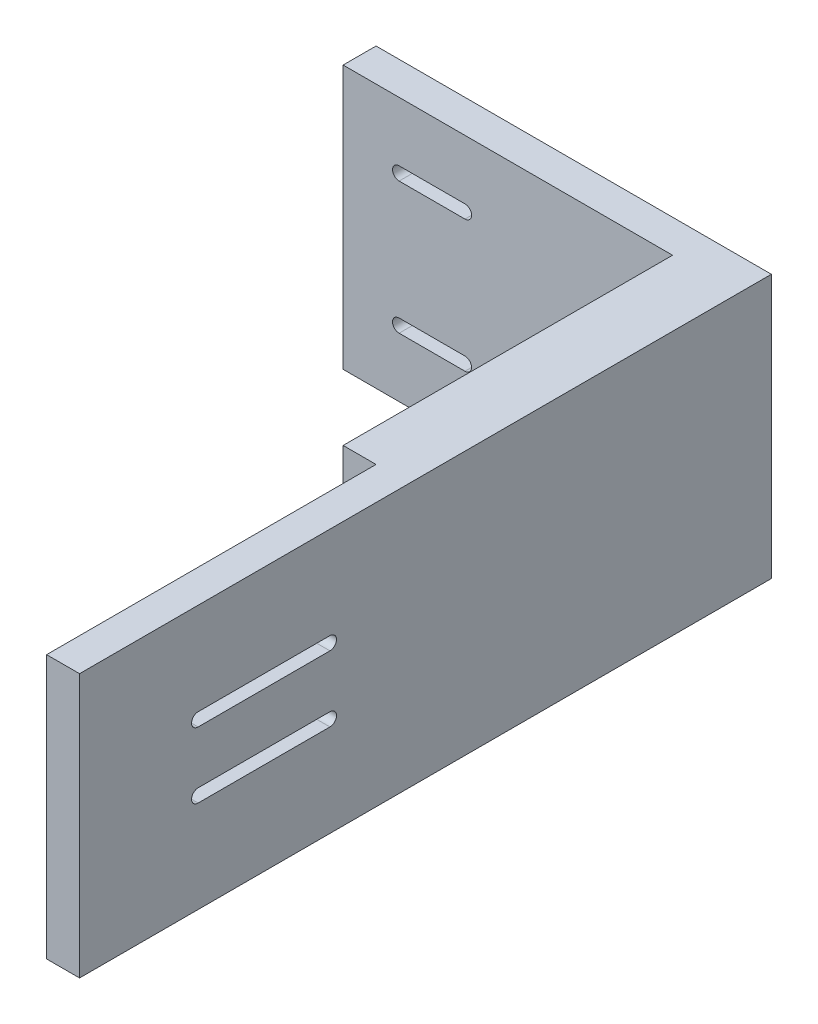
ISO-10303-21;
HEADER;
FILE_DESCRIPTION(('STEP AP214'),'2;1');
FILE_NAME('part.step','',(''),(''),'','','');
FILE_SCHEMA(('AUTOMOTIVE_DESIGN { 1 0 10303 214 1 1 1 1 }'));
ENDSEC;
DATA;
#1=APPLICATION_CONTEXT('core data for automotive mechanical design processes');
#2=APPLICATION_PROTOCOL_DEFINITION('international standard','automotive_design',2000,#1);
#3=PRODUCT_CONTEXT('',#1,'mechanical');
#4=PRODUCT('Part','Part','',(#3));
#5=PRODUCT_RELATED_PRODUCT_CATEGORY('part','',(#4));
#6=PRODUCT_DEFINITION_FORMATION('','',#4);
#7=PRODUCT_DEFINITION_CONTEXT('part definition',#1,'design');
#8=PRODUCT_DEFINITION('design','',#6,#7);
#9=PRODUCT_DEFINITION_SHAPE('','',#8);
#10=(LENGTH_UNIT() NAMED_UNIT(*) SI_UNIT(.MILLI.,.METRE.));
#11=(NAMED_UNIT(*) PLANE_ANGLE_UNIT() SI_UNIT($,.RADIAN.));
#12=(NAMED_UNIT(*) SI_UNIT($,.STERADIAN.) SOLID_ANGLE_UNIT());
#13=UNCERTAINTY_MEASURE_WITH_UNIT(LENGTH_MEASURE(1.E-05),#10,'distance_accuracy_value','');
#14=(GEOMETRIC_REPRESENTATION_CONTEXT(3) GLOBAL_UNCERTAINTY_ASSIGNED_CONTEXT((#13)) GLOBAL_UNIT_ASSIGNED_CONTEXT((#10,
#11,#12)) REPRESENTATION_CONTEXT('',''));
#15=CARTESIAN_POINT('',(0.,0.,0.));
#16=DIRECTION('',(0.,0.,1.));
#17=DIRECTION('',(1.,0.,0.));
#18=AXIS2_PLACEMENT_3D('',#15,#16,#17);
#19=CARTESIAN_POINT('',(30.,20.,5.));
#20=DIRECTION('',(-1.,0.,0.));
#21=DIRECTION('',(0.,-1.,0.));
#22=AXIS2_PLACEMENT_3D('',#19,#20,#21);
#23=PLANE('',#22);
#24=DIRECTION('',(0.,0.,-1.));
#25=VECTOR('',#24,1.);
#26=CARTESIAN_POINT('',(30.,6.,67.));
#27=LINE('',#26,#25);
#28=CARTESIAN_POINT('',(30.,6.,87.));
#29=VERTEX_POINT('',#28);
#30=CARTESIAN_POINT('',(30.,6.,67.));
#31=VERTEX_POINT('',#30);
#32=EDGE_CURVE('E358',#29,#31,#27,.T.);
#33=ORIENTED_EDGE('',*,*,#32,.T.);
#34=CARTESIAN_POINT('',(30.,5.,67.));
#35=DIRECTION('',(-1.,0.,0.));
#36=DIRECTION('',(0.,0.,1.));
#37=AXIS2_PLACEMENT_3D('',#34,#35,#36);
#38=CIRCLE('',#37,1.);
#39=CARTESIAN_POINT('',(30.,4.,67.));
#40=VERTEX_POINT('',#39);
#41=EDGE_CURVE('E345',#31,#40,#38,.T.);
#42=ORIENTED_EDGE('',*,*,#41,.T.);
#43=DIRECTION('',(0.,0.,1.));
#44=VECTOR('',#43,1.);
#45=CARTESIAN_POINT('',(30.,4.,67.));
#46=LINE('',#45,#44);
#47=CARTESIAN_POINT('',(30.,4.,87.));
#48=VERTEX_POINT('',#47);
#49=EDGE_CURVE('E349',#40,#48,#46,.T.);
#50=ORIENTED_EDGE('',*,*,#49,.T.);
#51=CARTESIAN_POINT('',(30.,5.,87.));
#52=DIRECTION('',(-1.,0.,0.));
#53=DIRECTION('',(0.,0.,1.));
#54=AXIS2_PLACEMENT_3D('',#51,#52,#53);
#55=CIRCLE('',#54,1.);
#56=EDGE_CURVE('E354',#48,#29,#55,.T.);
#57=ORIENTED_EDGE('',*,*,#56,.T.);
#58=EDGE_LOOP('',(#33,#42,#50,#57));
#59=FACE_BOUND('',#58,.T.);
#60=DIRECTION('',(0.,0.,-1.));
#61=VECTOR('',#60,1.);
#62=CARTESIAN_POINT('',(30.,-4.,67.));
#63=LINE('',#62,#61);
#64=CARTESIAN_POINT('',(30.,-4.,87.));
#65=VERTEX_POINT('',#64);
#66=CARTESIAN_POINT('',(30.,-4.,67.));
#67=VERTEX_POINT('',#66);
#68=EDGE_CURVE('E390',#65,#67,#63,.T.);
#69=ORIENTED_EDGE('',*,*,#68,.T.);
#70=CARTESIAN_POINT('',(30.,-5.,67.));
#71=DIRECTION('',(-1.,0.,0.));
#72=DIRECTION('',(0.,0.,-1.));
#73=AXIS2_PLACEMENT_3D('',#70,#71,#72);
#74=CIRCLE('',#73,1.);
#75=CARTESIAN_POINT('',(30.,-6.,67.));
#76=VERTEX_POINT('',#75);
#77=EDGE_CURVE('E344',#67,#76,#74,.T.);
#78=ORIENTED_EDGE('',*,*,#77,.T.);
#79=DIRECTION('',(0.,0.,1.));
#80=VECTOR('',#79,1.);
#81=CARTESIAN_POINT('',(30.,-6.,67.));
#82=LINE('',#81,#80);
#83=CARTESIAN_POINT('',(30.,-6.,87.));
#84=VERTEX_POINT('',#83);
#85=EDGE_CURVE('E382',#76,#84,#82,.T.);
#86=ORIENTED_EDGE('',*,*,#85,.T.);
#87=CARTESIAN_POINT('',(30.,-5.,87.));
#88=DIRECTION('',(-1.,0.,0.));
#89=DIRECTION('',(0.,0.,-1.));
#90=AXIS2_PLACEMENT_3D('',#87,#88,#89);
#91=CIRCLE('',#90,1.);
#92=EDGE_CURVE('E386',#84,#65,#91,.T.);
#93=ORIENTED_EDGE('',*,*,#92,.T.);
#94=EDGE_LOOP('',(#69,#78,#86,#93));
#95=FACE_BOUND('',#94,.T.);
#96=DIRECTION('',(0.,1.,0.));
#97=VECTOR('',#96,1.);
#98=CARTESIAN_POINT('',(30.,20.,0.));
#99=LINE('',#98,#97);
#100=CARTESIAN_POINT('',(30.,-20.,0.));
#101=VERTEX_POINT('',#100);
#102=CARTESIAN_POINT('',(30.,20.,0.));
#103=VERTEX_POINT('',#102);
#104=EDGE_CURVE('E433',#101,#103,#99,.T.);
#105=ORIENTED_EDGE('',*,*,#104,.T.);
#106=DIRECTION('',(0.,0.,-1.));
#107=VECTOR('',#106,1.);
#108=CARTESIAN_POINT('',(30.,20.,5.));
#109=LINE('',#108,#107);
#110=CARTESIAN_POINT('',(30.,20.,105.));
#111=VERTEX_POINT('',#110);
#112=EDGE_CURVE('E468',#111,#103,#109,.T.);
#113=ORIENTED_EDGE('',*,*,#112,.F.);
#114=DIRECTION('',(0.,1.,0.));
#115=VECTOR('',#114,1.);
#116=CARTESIAN_POINT('',(30.,20.,105.));
#117=LINE('',#116,#115);
#118=CARTESIAN_POINT('',(30.,-20.,105.));
#119=VERTEX_POINT('',#118);
#120=EDGE_CURVE('E416',#119,#111,#117,.T.);
#121=ORIENTED_EDGE('',*,*,#120,.F.);
#122=DIRECTION('',(0.,0.,-1.));
#123=VECTOR('',#122,1.);
#124=CARTESIAN_POINT('',(30.,-20.,5.));
#125=LINE('',#124,#123);
#126=EDGE_CURVE('E445',#119,#101,#125,.T.);
#127=ORIENTED_EDGE('',*,*,#126,.T.);
#128=EDGE_LOOP('',(#105,#113,#121,#127));
#129=FACE_BOUND('',#128,.T.);
#130=ADVANCED_FACE('F39',(#59,#95,#129),#23,.F.);
#131=CARTESIAN_POINT('',(-30.,20.,5.));
#132=DIRECTION('',(0.,-1.,0.));
#133=DIRECTION('',(0.,0.,-1.));
#134=AXIS2_PLACEMENT_3D('',#131,#132,#133);
#135=PLANE('',#134);
#136=DIRECTION('',(1.,0.,0.));
#137=VECTOR('',#136,1.);
#138=CARTESIAN_POINT('',(20.,20.,55.));
#139=LINE('',#138,#137);
#140=CARTESIAN_POINT('',(20.,20.,55.));
#141=VERTEX_POINT('',#140);
#142=CARTESIAN_POINT('',(25.,20.,55.));
#143=VERTEX_POINT('',#142);
#144=EDGE_CURVE('E292',#141,#143,#139,.T.);
#145=ORIENTED_EDGE('',*,*,#144,.T.);
#146=DIRECTION('',(0.,0.,1.));
#147=VECTOR('',#146,1.);
#148=CARTESIAN_POINT('',(25.,20.,105.));
#149=LINE('',#148,#147);
#150=CARTESIAN_POINT('',(25.,20.,105.));
#151=VERTEX_POINT('',#150);
#152=EDGE_CURVE('E296',#143,#151,#149,.T.);
#153=ORIENTED_EDGE('',*,*,#152,.T.);
#154=DIRECTION('',(-1.,0.,0.));
#155=VECTOR('',#154,1.);
#156=CARTESIAN_POINT('',(20.,20.,105.));
#157=LINE('',#156,#155);
#158=EDGE_CURVE('E420',#111,#151,#157,.T.);
#159=ORIENTED_EDGE('',*,*,#158,.F.);
#160=ORIENTED_EDGE('',*,*,#112,.T.);
#161=DIRECTION('',(-1.,0.,0.));
#162=VECTOR('',#161,1.);
#163=CARTESIAN_POINT('',(-30.,20.,0.));
#164=LINE('',#163,#162);
#165=CARTESIAN_POINT('',(-30.,20.,0.));
#166=VERTEX_POINT('',#165);
#167=EDGE_CURVE('E449',#103,#166,#164,.T.);
#168=ORIENTED_EDGE('',*,*,#167,.T.);
#169=DIRECTION('',(0.,0.,-1.));
#170=VECTOR('',#169,1.);
#171=CARTESIAN_POINT('',(-30.,20.,5.));
#172=LINE('',#171,#170);
#173=CARTESIAN_POINT('',(-30.,20.,5.));
#174=VERTEX_POINT('',#173);
#175=EDGE_CURVE('E464',#174,#166,#172,.T.);
#176=ORIENTED_EDGE('',*,*,#175,.F.);
#177=DIRECTION('',(-1.,0.,0.));
#178=VECTOR('',#177,1.);
#179=CARTESIAN_POINT('',(-30.,20.,5.));
#180=LINE('',#179,#178);
#181=CARTESIAN_POINT('',(20.,20.,5.));
#182=VERTEX_POINT('',#181);
#183=EDGE_CURVE('E434',#182,#174,#180,.T.);
#184=ORIENTED_EDGE('',*,*,#183,.F.);
#185=DIRECTION('',(0.,0.,-1.));
#186=VECTOR('',#185,1.);
#187=CARTESIAN_POINT('',(20.,20.,105.));
#188=LINE('',#187,#186);
#189=EDGE_CURVE('E424',#141,#182,#188,.T.);
#190=ORIENTED_EDGE('',*,*,#189,.F.);
#191=EDGE_LOOP('',(#145,#153,#159,#160,#168,#176,#184,#190));
#192=FACE_BOUND('',#191,.T.);
#193=ADVANCED_FACE('F514',(#192),#135,.F.);
#194=CARTESIAN_POINT('',(-30.,20.,5.));
#195=DIRECTION('',(1.,0.,0.));
#196=DIRECTION('',(0.,1.,0.));
#197=AXIS2_PLACEMENT_3D('',#194,#195,#196);
#198=PLANE('',#197);
#199=DIRECTION('',(0.,-1.,0.));
#200=VECTOR('',#199,1.);
#201=CARTESIAN_POINT('',(-30.,20.,0.));
#202=LINE('',#201,#200);
#203=CARTESIAN_POINT('',(-30.,-20.,0.));
#204=VERTEX_POINT('',#203);
#205=EDGE_CURVE('E452',#166,#204,#202,.T.);
#206=ORIENTED_EDGE('',*,*,#205,.T.);
#207=DIRECTION('',(0.,0.,-1.));
#208=VECTOR('',#207,1.);
#209=CARTESIAN_POINT('',(-30.,-20.,5.));
#210=LINE('',#209,#208);
#211=CARTESIAN_POINT('',(-30.,-20.,5.));
#212=VERTEX_POINT('',#211);
#213=EDGE_CURVE('E460',#212,#204,#210,.T.);
#214=ORIENTED_EDGE('',*,*,#213,.F.);
#215=DIRECTION('',(0.,-1.,0.));
#216=VECTOR('',#215,1.);
#217=CARTESIAN_POINT('',(-30.,20.,5.));
#218=LINE('',#217,#216);
#219=EDGE_CURVE('E437',#174,#212,#218,.T.);
#220=ORIENTED_EDGE('',*,*,#219,.F.);
#221=ORIENTED_EDGE('',*,*,#175,.T.);
#222=EDGE_LOOP('',(#206,#214,#220,#221));
#223=FACE_BOUND('',#222,.T.);
#224=ADVANCED_FACE('F499',(#223),#198,.F.);
#225=CARTESIAN_POINT('',(-30.,-20.,5.));
#226=DIRECTION('',(0.,1.,0.));
#227=DIRECTION('',(0.,0.,1.));
#228=AXIS2_PLACEMENT_3D('',#225,#226,#227);
#229=PLANE('',#228);
#230=DIRECTION('',(1.,0.,0.));
#231=VECTOR('',#230,1.);
#232=CARTESIAN_POINT('',(20.,-20.,105.));
#233=LINE('',#232,#231);
#234=CARTESIAN_POINT('',(25.,-20.,105.));
#235=VERTEX_POINT('',#234);
#236=EDGE_CURVE('E413',#235,#119,#233,.T.);
#237=ORIENTED_EDGE('',*,*,#236,.F.);
#238=DIRECTION('',(0.,0.,1.));
#239=VECTOR('',#238,1.);
#240=CARTESIAN_POINT('',(25.,-20.,105.));
#241=LINE('',#240,#239);
#242=CARTESIAN_POINT('',(25.,-20.,55.));
#243=VERTEX_POINT('',#242);
#244=EDGE_CURVE('E297',#243,#235,#241,.T.);
#245=ORIENTED_EDGE('',*,*,#244,.F.);
#246=DIRECTION('',(1.,0.,0.));
#247=VECTOR('',#246,1.);
#248=CARTESIAN_POINT('',(20.,-20.,55.));
#249=LINE('',#248,#247);
#250=CARTESIAN_POINT('',(20.,-20.,55.));
#251=VERTEX_POINT('',#250);
#252=EDGE_CURVE('E218',#251,#243,#249,.T.);
#253=ORIENTED_EDGE('',*,*,#252,.F.);
#254=DIRECTION('',(0.,0.,-1.));
#255=VECTOR('',#254,1.);
#256=CARTESIAN_POINT('',(20.,-20.,105.));
#257=LINE('',#256,#255);
#258=CARTESIAN_POINT('',(20.,-20.,5.));
#259=VERTEX_POINT('',#258);
#260=EDGE_CURVE('E430',#251,#259,#257,.T.);
#261=ORIENTED_EDGE('',*,*,#260,.T.);
#262=DIRECTION('',(1.,0.,0.));
#263=VECTOR('',#262,1.);
#264=CARTESIAN_POINT('',(-30.,-20.,5.));
#265=LINE('',#264,#263);
#266=EDGE_CURVE('E441',#212,#259,#265,.T.);
#267=ORIENTED_EDGE('',*,*,#266,.F.);
#268=ORIENTED_EDGE('',*,*,#213,.T.);
#269=DIRECTION('',(1.,0.,0.));
#270=VECTOR('',#269,1.);
#271=CARTESIAN_POINT('',(-30.,-20.,0.));
#272=LINE('',#271,#270);
#273=EDGE_CURVE('E438',#204,#101,#272,.T.);
#274=ORIENTED_EDGE('',*,*,#273,.T.);
#275=ORIENTED_EDGE('',*,*,#126,.F.);
#276=EDGE_LOOP('',(#237,#245,#253,#261,#267,#268,#274,#275));
#277=FACE_BOUND('',#276,.T.);
#278=ADVANCED_FACE('F490',(#277),#229,.F.);
#279=CARTESIAN_POINT('',(0.,0.,5.));
#280=DIRECTION('',(0.,0.,1.));
#281=DIRECTION('',(1.,0.,0.));
#282=AXIS2_PLACEMENT_3D('',#279,#280,#281);
#283=PLANE('',#282);
#284=CARTESIAN_POINT('',(-11.5,10.,5.));
#285=DIRECTION('',(0.,0.,1.));
#286=DIRECTION('',(1.,0.,0.));
#287=AXIS2_PLACEMENT_3D('',#284,#285,#286);
#288=CIRCLE('',#287,0.99853166404924);
#289=CARTESIAN_POINT('',(-11.5,9.00146833595076,5.));
#290=VERTEX_POINT('',#289);
#291=CARTESIAN_POINT('',(-11.5,10.9985316640492,5.));
#292=VERTEX_POINT('',#291);
#293=EDGE_CURVE('E54',#290,#292,#288,.T.);
#294=ORIENTED_EDGE('',*,*,#293,.F.);
#295=DIRECTION('',(1.,0.,0.));
#296=VECTOR('',#295,1.);
#297=CARTESIAN_POINT('',(-11.5,9.00146833595076,5.));
#298=LINE('',#297,#296);
#299=CARTESIAN_POINT('',(-21.5,9.00146833595076,5.));
#300=VERTEX_POINT('',#299);
#301=EDGE_CURVE('E209',#300,#290,#298,.T.);
#302=ORIENTED_EDGE('',*,*,#301,.F.);
#303=CARTESIAN_POINT('',(-21.5,10.,5.));
#304=DIRECTION('',(0.,0.,1.));
#305=DIRECTION('',(1.,0.,0.));
#306=AXIS2_PLACEMENT_3D('',#303,#304,#305);
#307=CIRCLE('',#306,0.99853166404924);
#308=CARTESIAN_POINT('',(-21.5,10.9985316640492,5.));
#309=VERTEX_POINT('',#308);
#310=EDGE_CURVE('E237',#309,#300,#307,.T.);
#311=ORIENTED_EDGE('',*,*,#310,.F.);
#312=DIRECTION('',(-1.,0.,0.));
#313=VECTOR('',#312,1.);
#314=CARTESIAN_POINT('',(-11.5,10.9985316640492,5.));
#315=LINE('',#314,#313);
#316=EDGE_CURVE('E229',#292,#309,#315,.T.);
#317=ORIENTED_EDGE('',*,*,#316,.F.);
#318=EDGE_LOOP('',(#294,#302,#311,#317));
#319=FACE_BOUND('',#318,.T.);
#320=CARTESIAN_POINT('',(-11.5,-10.,5.));
#321=DIRECTION('',(0.,0.,1.));
#322=DIRECTION('',(-1.,0.,0.));
#323=AXIS2_PLACEMENT_3D('',#320,#321,#322);
#324=CIRCLE('',#323,0.99853166404924);
#325=CARTESIAN_POINT('',(-11.5,-10.9985316640492,5.));
#326=VERTEX_POINT('',#325);
#327=CARTESIAN_POINT('',(-11.5,-9.00146833595076,5.));
#328=VERTEX_POINT('',#327);
#329=EDGE_CURVE('E62',#326,#328,#324,.T.);
#330=ORIENTED_EDGE('',*,*,#329,.F.);
#331=DIRECTION('',(1.,0.,0.));
#332=VECTOR('',#331,1.);
#333=CARTESIAN_POINT('',(-11.5,-10.9985316640492,5.));
#334=LINE('',#333,#332);
#335=CARTESIAN_POINT('',(-21.5,-10.9985316640492,5.));
#336=VERTEX_POINT('',#335);
#337=EDGE_CURVE('E272',#336,#326,#334,.T.);
#338=ORIENTED_EDGE('',*,*,#337,.F.);
#339=CARTESIAN_POINT('',(-21.5,-10.,5.));
#340=DIRECTION('',(0.,0.,1.));
#341=DIRECTION('',(-1.,0.,0.));
#342=AXIS2_PLACEMENT_3D('',#339,#340,#341);
#343=CIRCLE('',#342,0.99853166404924);
#344=CARTESIAN_POINT('',(-21.5,-9.00146833595076,5.));
#345=VERTEX_POINT('',#344);
#346=EDGE_CURVE('E268',#345,#336,#343,.T.);
#347=ORIENTED_EDGE('',*,*,#346,.F.);
#348=DIRECTION('',(-1.,0.,0.));
#349=VECTOR('',#348,1.);
#350=CARTESIAN_POINT('',(-11.5,-9.00146833595076,5.));
#351=LINE('',#350,#349);
#352=EDGE_CURVE('E264',#328,#345,#351,.T.);
#353=ORIENTED_EDGE('',*,*,#352,.F.);
#354=EDGE_LOOP('',(#330,#338,#347,#353));
#355=FACE_BOUND('',#354,.T.);
#356=DIRECTION('',(0.,-1.,0.));
#357=VECTOR('',#356,1.);
#358=CARTESIAN_POINT('',(20.,20.,5.));
#359=LINE('',#358,#357);
#360=EDGE_CURVE('E412',#182,#259,#359,.T.);
#361=ORIENTED_EDGE('',*,*,#360,.F.);
#362=ORIENTED_EDGE('',*,*,#183,.T.);
#363=ORIENTED_EDGE('',*,*,#219,.T.);
#364=ORIENTED_EDGE('',*,*,#266,.T.);
#365=EDGE_LOOP('',(#361,#362,#363,#364));
#366=FACE_BOUND('',#365,.T.);
#367=ADVANCED_FACE('F493',(#319,#355,#366),#283,.T.);
#368=CARTESIAN_POINT('',(0.,0.,0.));
#369=DIRECTION('',(0.,0.,1.));
#370=DIRECTION('',(1.,0.,0.));
#371=AXIS2_PLACEMENT_3D('',#368,#369,#370);
#372=PLANE('',#371);
#373=DIRECTION('',(-1.,0.,0.));
#374=VECTOR('',#373,1.);
#375=CARTESIAN_POINT('',(-11.5,9.00146833595076,0.));
#376=LINE('',#375,#374);
#377=CARTESIAN_POINT('',(-11.5,9.00146833595076,0.));
#378=VERTEX_POINT('',#377);
#379=CARTESIAN_POINT('',(-21.5,9.00146833595076,0.));
#380=VERTEX_POINT('',#379);
#381=EDGE_CURVE('E224',#378,#380,#376,.T.);
#382=ORIENTED_EDGE('',*,*,#381,.F.);
#383=CARTESIAN_POINT('',(-11.5,10.,0.));
#384=DIRECTION('',(0.,0.,1.));
#385=DIRECTION('',(1.,0.,0.));
#386=AXIS2_PLACEMENT_3D('',#383,#384,#385);
#387=CIRCLE('',#386,0.99853166404924);
#388=CARTESIAN_POINT('',(-11.5,10.9985316640492,0.));
#389=VERTEX_POINT('',#388);
#390=EDGE_CURVE('E202',#389,#378,#387,.F.);
#391=ORIENTED_EDGE('',*,*,#390,.F.);
#392=DIRECTION('',(1.,0.,0.));
#393=VECTOR('',#392,1.);
#394=CARTESIAN_POINT('',(-11.5,10.9985316640492,0.));
#395=LINE('',#394,#393);
#396=CARTESIAN_POINT('',(-21.5,10.9985316640492,0.));
#397=VERTEX_POINT('',#396);
#398=EDGE_CURVE('E213',#397,#389,#395,.T.);
#399=ORIENTED_EDGE('',*,*,#398,.F.);
#400=CARTESIAN_POINT('',(-21.5,10.,0.));
#401=DIRECTION('',(0.,0.,1.));
#402=DIRECTION('',(1.,0.,0.));
#403=AXIS2_PLACEMENT_3D('',#400,#401,#402);
#404=CIRCLE('',#403,0.99853166404924);
#405=EDGE_CURVE('E231',#380,#397,#404,.F.);
#406=ORIENTED_EDGE('',*,*,#405,.F.);
#407=EDGE_LOOP('',(#382,#391,#399,#406));
#408=FACE_BOUND('',#407,.T.);
#409=DIRECTION('',(-1.,0.,0.));
#410=VECTOR('',#409,1.);
#411=CARTESIAN_POINT('',(-11.5,-10.9985316640492,0.));
#412=LINE('',#411,#410);
#413=CARTESIAN_POINT('',(-11.5,-10.9985316640492,0.));
#414=VERTEX_POINT('',#413);
#415=CARTESIAN_POINT('',(-21.5,-10.9985316640492,0.));
#416=VERTEX_POINT('',#415);
#417=EDGE_CURVE('E254',#414,#416,#412,.T.);
#418=ORIENTED_EDGE('',*,*,#417,.F.);
#419=CARTESIAN_POINT('',(-11.5,-10.,0.));
#420=DIRECTION('',(0.,0.,1.));
#421=DIRECTION('',(1.,0.,0.));
#422=AXIS2_PLACEMENT_3D('',#419,#420,#421);
#423=CIRCLE('',#422,0.99853166404924);
#424=CARTESIAN_POINT('',(-11.5,-9.00146833595076,0.));
#425=VERTEX_POINT('',#424);
#426=EDGE_CURVE('E258',#425,#414,#423,.F.);
#427=ORIENTED_EDGE('',*,*,#426,.F.);
#428=DIRECTION('',(1.,0.,0.));
#429=VECTOR('',#428,1.);
#430=CARTESIAN_POINT('',(-11.5,-9.00146833595076,0.));
#431=LINE('',#430,#429);
#432=CARTESIAN_POINT('',(-21.5,-9.00146833595076,0.));
#433=VERTEX_POINT('',#432);
#434=EDGE_CURVE('E280',#433,#425,#431,.T.);
#435=ORIENTED_EDGE('',*,*,#434,.F.);
#436=CARTESIAN_POINT('',(-21.5,-10.,0.));
#437=DIRECTION('',(0.,0.,1.));
#438=DIRECTION('',(1.,0.,0.));
#439=AXIS2_PLACEMENT_3D('',#436,#437,#438);
#440=CIRCLE('',#439,0.99853166404924);
#441=EDGE_CURVE('E251',#416,#433,#440,.F.);
#442=ORIENTED_EDGE('',*,*,#441,.F.);
#443=EDGE_LOOP('',(#418,#427,#435,#442));
#444=FACE_BOUND('',#443,.T.);
#445=ORIENTED_EDGE('',*,*,#104,.F.);
#446=ORIENTED_EDGE('',*,*,#273,.F.);
#447=ORIENTED_EDGE('',*,*,#205,.F.);
#448=ORIENTED_EDGE('',*,*,#167,.F.);
#449=EDGE_LOOP('',(#445,#446,#447,#448));
#450=FACE_BOUND('',#449,.T.);
#451=ADVANCED_FACE('F221',(#408,#444,#450),#372,.F.);
#452=CARTESIAN_POINT('',(20.,20.,105.));
#453=DIRECTION('',(1.,0.,0.));
#454=DIRECTION('',(0.,1.,0.));
#455=AXIS2_PLACEMENT_3D('',#452,#453,#454);
#456=PLANE('',#455);
#457=CARTESIAN_POINT('',(20.,0.,30.));
#458=DIRECTION('',(1.,0.,0.));
#459=DIRECTION('',(0.,1.,0.));
#460=AXIS2_PLACEMENT_3D('',#457,#458,#459);
#461=CIRCLE('',#460,0.999999999999998);
#462=CARTESIAN_POINT('',(20.,1.,30.));
#463=VERTEX_POINT('',#462);
#464=EDGE_CURVE('E47',#463,#463,#461,.F.);
#465=ORIENTED_EDGE('',*,*,#464,.F.);
#466=EDGE_LOOP('',(#465));
#467=FACE_BOUND('',#466,.T.);
#468=ORIENTED_EDGE('',*,*,#260,.F.);
#469=DIRECTION('',(0.,-1.,0.));
#470=VECTOR('',#469,1.);
#471=CARTESIAN_POINT('',(20.,20.,55.));
#472=LINE('',#471,#470);
#473=EDGE_CURVE('E301',#141,#251,#472,.T.);
#474=ORIENTED_EDGE('',*,*,#473,.F.);
#475=ORIENTED_EDGE('',*,*,#189,.T.);
#476=ORIENTED_EDGE('',*,*,#360,.T.);
#477=EDGE_LOOP('',(#468,#474,#475,#476));
#478=FACE_BOUND('',#477,.T.);
#479=ADVANCED_FACE('F477',(#467,#478),#456,.F.);
#480=CARTESIAN_POINT('',(0.,0.,105.));
#481=DIRECTION('',(0.,0.,1.));
#482=DIRECTION('',(1.,0.,0.));
#483=AXIS2_PLACEMENT_3D('',#480,#481,#482);
#484=PLANE('',#483);
#485=DIRECTION('',(0.,-1.,0.));
#486=VECTOR('',#485,1.);
#487=CARTESIAN_POINT('',(25.,20.,105.));
#488=LINE('',#487,#486);
#489=EDGE_CURVE('E307',#151,#235,#488,.T.);
#490=ORIENTED_EDGE('',*,*,#489,.T.);
#491=ORIENTED_EDGE('',*,*,#236,.T.);
#492=ORIENTED_EDGE('',*,*,#120,.T.);
#493=ORIENTED_EDGE('',*,*,#158,.T.);
#494=EDGE_LOOP('',(#490,#491,#492,#493));
#495=FACE_BOUND('',#494,.T.);
#496=ADVANCED_FACE('F480',(#495),#484,.T.);
#497=CARTESIAN_POINT('',(17.5,0.,30.));
#498=DIRECTION('',(1.,0.,0.));
#499=DIRECTION('',(0.,0.,-1.));
#500=AXIS2_PLACEMENT_3D('',#497,#498,#499);
#501=CYLINDRICAL_SURFACE('',#500,0.999999999999998);
#502=CARTESIAN_POINT('',(17.5,0.,30.));
#503=DIRECTION('',(-1.,0.,0.));
#504=DIRECTION('',(0.,0.,1.));
#505=AXIS2_PLACEMENT_3D('',#502,#503,#504);
#506=CIRCLE('',#505,0.999999999999998);
#507=CARTESIAN_POINT('',(17.5,0.,31.));
#508=VERTEX_POINT('',#507);
#509=EDGE_CURVE('E367',#508,#508,#506,.T.);
#510=ORIENTED_EDGE('',*,*,#509,.F.);
#511=EDGE_LOOP('',(#510));
#512=FACE_BOUND('',#511,.T.);
#513=ORIENTED_EDGE('',*,*,#464,.T.);
#514=EDGE_LOOP('',(#513));
#515=FACE_BOUND('',#514,.T.);
#516=ADVANCED_FACE('F475',(#512,#515),#501,.T.);
#517=CARTESIAN_POINT('',(17.5,0.,30.));
#518=DIRECTION('',(-1.,0.,0.));
#519=DIRECTION('',(0.,0.,1.));
#520=AXIS2_PLACEMENT_3D('',#517,#518,#519);
#521=PLANE('',#520);
#522=ORIENTED_EDGE('',*,*,#509,.T.);
#523=EDGE_LOOP('',(#522));
#524=FACE_BOUND('',#523,.T.);
#525=ADVANCED_FACE('F562',(#524),#521,.T.);
#526=CARTESIAN_POINT('',(30.,-5.,67.));
#527=DIRECTION('',(-1.,0.,0.));
#528=DIRECTION('',(0.,0.,1.));
#529=AXIS2_PLACEMENT_3D('',#526,#527,#528);
#530=CYLINDRICAL_SURFACE('',#529,1.);
#531=DIRECTION('',(-1.,0.,0.));
#532=VECTOR('',#531,1.);
#533=CARTESIAN_POINT('',(30.,-4.,67.));
#534=LINE('',#533,#532);
#535=CARTESIAN_POINT('',(25.,-4.,67.));
#536=VERTEX_POINT('',#535);
#537=EDGE_CURVE('E350',#67,#536,#534,.T.);
#538=ORIENTED_EDGE('',*,*,#537,.T.);
#539=CARTESIAN_POINT('',(25.,-5.,67.));
#540=DIRECTION('',(1.,0.,0.));
#541=DIRECTION('',(0.,0.,-1.));
#542=AXIS2_PLACEMENT_3D('',#539,#540,#541);
#543=CIRCLE('',#542,1.);
#544=CARTESIAN_POINT('',(25.,-6.,67.));
#545=VERTEX_POINT('',#544);
#546=EDGE_CURVE('E340',#536,#545,#543,.F.);
#547=ORIENTED_EDGE('',*,*,#546,.T.);
#548=DIRECTION('',(-1.,0.,0.));
#549=VECTOR('',#548,1.);
#550=CARTESIAN_POINT('',(30.,-6.,67.));
#551=LINE('',#550,#549);
#552=EDGE_CURVE('E394',#76,#545,#551,.T.);
#553=ORIENTED_EDGE('',*,*,#552,.F.);
#554=ORIENTED_EDGE('',*,*,#77,.F.);
#555=EDGE_LOOP('',(#538,#547,#553,#554));
#556=FACE_BOUND('',#555,.T.);
#557=ADVANCED_FACE('F541',(#556),#530,.F.);
#558=CARTESIAN_POINT('',(30.,-4.,67.));
#559=DIRECTION('',(0.,1.,0.));
#560=DIRECTION('',(0.,0.,1.));
#561=AXIS2_PLACEMENT_3D('',#558,#559,#560);
#562=PLANE('',#561);
#563=DIRECTION('',(-1.,0.,0.));
#564=VECTOR('',#563,1.);
#565=CARTESIAN_POINT('',(30.,-4.,87.));
#566=LINE('',#565,#564);
#567=CARTESIAN_POINT('',(25.,-4.,87.));
#568=VERTEX_POINT('',#567);
#569=EDGE_CURVE('E398',#65,#568,#566,.T.);
#570=ORIENTED_EDGE('',*,*,#569,.T.);
#571=DIRECTION('',(0.,0.,-1.));
#572=VECTOR('',#571,1.);
#573=CARTESIAN_POINT('',(25.,-4.,67.));
#574=LINE('',#573,#572);
#575=EDGE_CURVE('E336',#568,#536,#574,.T.);
#576=ORIENTED_EDGE('',*,*,#575,.T.);
#577=ORIENTED_EDGE('',*,*,#537,.F.);
#578=ORIENTED_EDGE('',*,*,#68,.F.);
#579=EDGE_LOOP('',(#570,#576,#577,#578));
#580=FACE_BOUND('',#579,.T.);
#581=ADVANCED_FACE('F539',(#580),#562,.F.);
#582=CARTESIAN_POINT('',(30.,-5.,87.));
#583=DIRECTION('',(-1.,0.,0.));
#584=DIRECTION('',(0.,0.,1.));
#585=AXIS2_PLACEMENT_3D('',#582,#583,#584);
#586=CYLINDRICAL_SURFACE('',#585,1.);
#587=DIRECTION('',(-1.,0.,0.));
#588=VECTOR('',#587,1.);
#589=CARTESIAN_POINT('',(30.,-6.,87.));
#590=LINE('',#589,#588);
#591=CARTESIAN_POINT('',(25.,-6.,87.));
#592=VERTEX_POINT('',#591);
#593=EDGE_CURVE('E402',#84,#592,#590,.T.);
#594=ORIENTED_EDGE('',*,*,#593,.T.);
#595=CARTESIAN_POINT('',(25.,-5.,87.));
#596=DIRECTION('',(1.,0.,0.));
#597=DIRECTION('',(0.,0.,-1.));
#598=AXIS2_PLACEMENT_3D('',#595,#596,#597);
#599=CIRCLE('',#598,1.);
#600=EDGE_CURVE('E332',#592,#568,#599,.F.);
#601=ORIENTED_EDGE('',*,*,#600,.T.);
#602=ORIENTED_EDGE('',*,*,#569,.F.);
#603=ORIENTED_EDGE('',*,*,#92,.F.);
#604=EDGE_LOOP('',(#594,#601,#602,#603));
#605=FACE_BOUND('',#604,.T.);
#606=ADVANCED_FACE('F547',(#605),#586,.F.);
#607=CARTESIAN_POINT('',(30.,-6.,67.));
#608=DIRECTION('',(0.,-1.,0.));
#609=DIRECTION('',(0.,0.,-1.));
#610=AXIS2_PLACEMENT_3D('',#607,#608,#609);
#611=PLANE('',#610);
#612=ORIENTED_EDGE('',*,*,#552,.T.);
#613=DIRECTION('',(0.,0.,1.));
#614=VECTOR('',#613,1.);
#615=CARTESIAN_POINT('',(25.,-6.,67.));
#616=LINE('',#615,#614);
#617=EDGE_CURVE('E328',#545,#592,#616,.T.);
#618=ORIENTED_EDGE('',*,*,#617,.T.);
#619=ORIENTED_EDGE('',*,*,#593,.F.);
#620=ORIENTED_EDGE('',*,*,#85,.F.);
#621=EDGE_LOOP('',(#612,#618,#619,#620));
#622=FACE_BOUND('',#621,.T.);
#623=ADVANCED_FACE('F545',(#622),#611,.F.);
#624=CARTESIAN_POINT('',(30.,5.,67.));
#625=DIRECTION('',(-1.,0.,0.));
#626=DIRECTION('',(0.,0.,1.));
#627=AXIS2_PLACEMENT_3D('',#624,#625,#626);
#628=CYLINDRICAL_SURFACE('',#627,1.);
#629=DIRECTION('',(-1.,0.,0.));
#630=VECTOR('',#629,1.);
#631=CARTESIAN_POINT('',(30.,6.,67.));
#632=LINE('',#631,#630);
#633=CARTESIAN_POINT('',(25.,6.,67.));
#634=VERTEX_POINT('',#633);
#635=EDGE_CURVE('E363',#31,#634,#632,.T.);
#636=ORIENTED_EDGE('',*,*,#635,.T.);
#637=CARTESIAN_POINT('',(25.,5.,67.));
#638=DIRECTION('',(1.,0.,0.));
#639=DIRECTION('',(0.,0.,-1.));
#640=AXIS2_PLACEMENT_3D('',#637,#638,#639);
#641=CIRCLE('',#640,1.);
#642=CARTESIAN_POINT('',(25.,4.,67.));
#643=VERTEX_POINT('',#642);
#644=EDGE_CURVE('E324',#634,#643,#641,.F.);
#645=ORIENTED_EDGE('',*,*,#644,.T.);
#646=DIRECTION('',(-1.,0.,0.));
#647=VECTOR('',#646,1.);
#648=CARTESIAN_POINT('',(30.,4.,67.));
#649=LINE('',#648,#647);
#650=EDGE_CURVE('E362',#40,#643,#649,.T.);
#651=ORIENTED_EDGE('',*,*,#650,.F.);
#652=ORIENTED_EDGE('',*,*,#41,.F.);
#653=EDGE_LOOP('',(#636,#645,#651,#652));
#654=FACE_BOUND('',#653,.T.);
#655=ADVANCED_FACE('F555',(#654),#628,.F.);
#656=CARTESIAN_POINT('',(30.,6.,67.));
#657=DIRECTION('',(0.,1.,0.));
#658=DIRECTION('',(0.,0.,1.));
#659=AXIS2_PLACEMENT_3D('',#656,#657,#658);
#660=PLANE('',#659);
#661=DIRECTION('',(-1.,0.,0.));
#662=VECTOR('',#661,1.);
#663=CARTESIAN_POINT('',(30.,6.,87.));
#664=LINE('',#663,#662);
#665=CARTESIAN_POINT('',(25.,6.,87.));
#666=VERTEX_POINT('',#665);
#667=EDGE_CURVE('E368',#29,#666,#664,.T.);
#668=ORIENTED_EDGE('',*,*,#667,.T.);
#669=DIRECTION('',(0.,0.,-1.));
#670=VECTOR('',#669,1.);
#671=CARTESIAN_POINT('',(25.,6.,67.));
#672=LINE('',#671,#670);
#673=EDGE_CURVE('E320',#666,#634,#672,.T.);
#674=ORIENTED_EDGE('',*,*,#673,.T.);
#675=ORIENTED_EDGE('',*,*,#635,.F.);
#676=ORIENTED_EDGE('',*,*,#32,.F.);
#677=EDGE_LOOP('',(#668,#674,#675,#676));
#678=FACE_BOUND('',#677,.T.);
#679=ADVANCED_FACE('F639',(#678),#660,.F.);
#680=CARTESIAN_POINT('',(30.,5.,87.));
#681=DIRECTION('',(-1.,0.,0.));
#682=DIRECTION('',(0.,0.,1.));
#683=AXIS2_PLACEMENT_3D('',#680,#681,#682);
#684=CYLINDRICAL_SURFACE('',#683,1.);
#685=DIRECTION('',(-1.,0.,0.));
#686=VECTOR('',#685,1.);
#687=CARTESIAN_POINT('',(30.,4.,87.));
#688=LINE('',#687,#686);
#689=CARTESIAN_POINT('',(25.,4.,87.));
#690=VERTEX_POINT('',#689);
#691=EDGE_CURVE('E372',#48,#690,#688,.T.);
#692=ORIENTED_EDGE('',*,*,#691,.T.);
#693=CARTESIAN_POINT('',(25.,5.,87.));
#694=DIRECTION('',(1.,0.,0.));
#695=DIRECTION('',(0.,0.,-1.));
#696=AXIS2_PLACEMENT_3D('',#693,#694,#695);
#697=CIRCLE('',#696,1.);
#698=EDGE_CURVE('E311',#690,#666,#697,.F.);
#699=ORIENTED_EDGE('',*,*,#698,.T.);
#700=ORIENTED_EDGE('',*,*,#667,.F.);
#701=ORIENTED_EDGE('',*,*,#56,.F.);
#702=EDGE_LOOP('',(#692,#699,#700,#701));
#703=FACE_BOUND('',#702,.T.);
#704=ADVANCED_FACE('F648',(#703),#684,.F.);
#705=CARTESIAN_POINT('',(30.,4.,67.));
#706=DIRECTION('',(0.,-1.,0.));
#707=DIRECTION('',(0.,0.,-1.));
#708=AXIS2_PLACEMENT_3D('',#705,#706,#707);
#709=PLANE('',#708);
#710=ORIENTED_EDGE('',*,*,#650,.T.);
#711=DIRECTION('',(0.,0.,1.));
#712=VECTOR('',#711,1.);
#713=CARTESIAN_POINT('',(25.,4.,67.));
#714=LINE('',#713,#712);
#715=EDGE_CURVE('E11',#643,#690,#714,.T.);
#716=ORIENTED_EDGE('',*,*,#715,.T.);
#717=ORIENTED_EDGE('',*,*,#691,.F.);
#718=ORIENTED_EDGE('',*,*,#49,.F.);
#719=EDGE_LOOP('',(#710,#716,#717,#718));
#720=FACE_BOUND('',#719,.T.);
#721=ADVANCED_FACE('F526',(#720),#709,.F.);
#722=CARTESIAN_POINT('',(25.,20.,105.));
#723=DIRECTION('',(1.,0.,0.));
#724=DIRECTION('',(0.,0.,-1.));
#725=AXIS2_PLACEMENT_3D('',#722,#723,#724);
#726=PLANE('',#725);
#727=ORIENTED_EDGE('',*,*,#244,.T.);
#728=ORIENTED_EDGE('',*,*,#489,.F.);
#729=ORIENTED_EDGE('',*,*,#152,.F.);
#730=DIRECTION('',(0.,-1.,0.));
#731=VECTOR('',#730,1.);
#732=CARTESIAN_POINT('',(25.,20.,55.));
#733=LINE('',#732,#731);
#734=EDGE_CURVE('E312',#143,#243,#733,.T.);
#735=ORIENTED_EDGE('',*,*,#734,.T.);
#736=EDGE_LOOP('',(#727,#728,#729,#735));
#737=FACE_BOUND('',#736,.T.);
#738=ORIENTED_EDGE('',*,*,#673,.F.);
#739=ORIENTED_EDGE('',*,*,#698,.F.);
#740=ORIENTED_EDGE('',*,*,#715,.F.);
#741=ORIENTED_EDGE('',*,*,#644,.F.);
#742=EDGE_LOOP('',(#738,#739,#740,#741));
#743=FACE_BOUND('',#742,.T.);
#744=ORIENTED_EDGE('',*,*,#575,.F.);
#745=ORIENTED_EDGE('',*,*,#600,.F.);
#746=ORIENTED_EDGE('',*,*,#617,.F.);
#747=ORIENTED_EDGE('',*,*,#546,.F.);
#748=EDGE_LOOP('',(#744,#745,#746,#747));
#749=FACE_BOUND('',#748,.T.);
#750=ADVANCED_FACE('F511',(#737,#743,#749),#726,.F.);
#751=CARTESIAN_POINT('',(20.,20.,55.));
#752=DIRECTION('',(0.,0.,-1.));
#753=DIRECTION('',(-1.,0.,0.));
#754=AXIS2_PLACEMENT_3D('',#751,#752,#753);
#755=PLANE('',#754);
#756=ORIENTED_EDGE('',*,*,#252,.T.);
#757=ORIENTED_EDGE('',*,*,#734,.F.);
#758=ORIENTED_EDGE('',*,*,#144,.F.);
#759=ORIENTED_EDGE('',*,*,#473,.T.);
#760=EDGE_LOOP('',(#756,#757,#758,#759));
#761=FACE_BOUND('',#760,.T.);
#762=ADVANCED_FACE('F516',(#761),#755,.F.);
#763=CARTESIAN_POINT('',(-11.5,-10.,-0.00100000000000013));
#764=DIRECTION('',(0.,0.,1.));
#765=DIRECTION('',(1.,0.,0.));
#766=AXIS2_PLACEMENT_3D('',#763,#764,#765);
#767=CYLINDRICAL_SURFACE('',#766,0.99853166404924);
#768=ORIENTED_EDGE('',*,*,#426,.T.);
#769=DIRECTION('',(0.,0.,1.));
#770=VECTOR('',#769,1.);
#771=CARTESIAN_POINT('',(-11.5,-10.9985316640492,-0.00100000000000013));
#772=LINE('',#771,#770);
#773=EDGE_CURVE('E277',#414,#326,#772,.T.);
#774=ORIENTED_EDGE('',*,*,#773,.T.);
#775=ORIENTED_EDGE('',*,*,#329,.T.);
#776=DIRECTION('',(0.,0.,1.));
#777=VECTOR('',#776,1.);
#778=CARTESIAN_POINT('',(-11.5,-9.00146833595076,-0.00100000000000013));
#779=LINE('',#778,#777);
#780=EDGE_CURVE('E276',#425,#328,#779,.T.);
#781=ORIENTED_EDGE('',*,*,#780,.F.);
#782=EDGE_LOOP('',(#768,#774,#775,#781));
#783=FACE_BOUND('',#782,.T.);
#784=ADVANCED_FACE('F518',(#783),#767,.F.);
#785=CARTESIAN_POINT('',(-11.5,-10.9985316640492,-0.00100000000000013));
#786=DIRECTION('',(0.,-1.,0.));
#787=DIRECTION('',(0.,0.,-1.));
#788=AXIS2_PLACEMENT_3D('',#785,#786,#787);
#789=PLANE('',#788);
#790=ORIENTED_EDGE('',*,*,#417,.T.);
#791=DIRECTION('',(0.,0.,1.));
#792=VECTOR('',#791,1.);
#793=CARTESIAN_POINT('',(-21.5,-10.9985316640492,-0.00100000000000013));
#794=LINE('',#793,#792);
#795=EDGE_CURVE('E281',#416,#336,#794,.T.);
#796=ORIENTED_EDGE('',*,*,#795,.T.);
#797=ORIENTED_EDGE('',*,*,#337,.T.);
#798=ORIENTED_EDGE('',*,*,#773,.F.);
#799=EDGE_LOOP('',(#790,#796,#797,#798));
#800=FACE_BOUND('',#799,.T.);
#801=ADVANCED_FACE('F524',(#800),#789,.F.);
#802=CARTESIAN_POINT('',(-21.5,-10.,-0.00100000000000013));
#803=DIRECTION('',(0.,0.,1.));
#804=DIRECTION('',(1.,0.,0.));
#805=AXIS2_PLACEMENT_3D('',#802,#803,#804);
#806=CYLINDRICAL_SURFACE('',#805,0.99853166404924);
#807=ORIENTED_EDGE('',*,*,#441,.T.);
#808=DIRECTION('',(0.,0.,1.));
#809=VECTOR('',#808,1.);
#810=CARTESIAN_POINT('',(-21.5,-9.00146833595076,-0.00100000000000013));
#811=LINE('',#810,#809);
#812=EDGE_CURVE('E284',#433,#345,#811,.T.);
#813=ORIENTED_EDGE('',*,*,#812,.T.);
#814=ORIENTED_EDGE('',*,*,#346,.T.);
#815=ORIENTED_EDGE('',*,*,#795,.F.);
#816=EDGE_LOOP('',(#807,#813,#814,#815));
#817=FACE_BOUND('',#816,.T.);
#818=ADVANCED_FACE('F690',(#817),#806,.F.);
#819=CARTESIAN_POINT('',(-11.5,-9.00146833595076,-0.00100000000000013));
#820=DIRECTION('',(0.,1.,0.));
#821=DIRECTION('',(0.,0.,1.));
#822=AXIS2_PLACEMENT_3D('',#819,#820,#821);
#823=PLANE('',#822);
#824=ORIENTED_EDGE('',*,*,#434,.T.);
#825=ORIENTED_EDGE('',*,*,#780,.T.);
#826=ORIENTED_EDGE('',*,*,#352,.T.);
#827=ORIENTED_EDGE('',*,*,#812,.F.);
#828=EDGE_LOOP('',(#824,#825,#826,#827));
#829=FACE_BOUND('',#828,.T.);
#830=ADVANCED_FACE('F699',(#829),#823,.F.);
#831=CARTESIAN_POINT('',(-11.5,10.,-0.00100000000000013));
#832=DIRECTION('',(0.,0.,1.));
#833=DIRECTION('',(1.,0.,0.));
#834=AXIS2_PLACEMENT_3D('',#831,#832,#833);
#835=CYLINDRICAL_SURFACE('',#834,0.99853166404924);
#836=ORIENTED_EDGE('',*,*,#390,.T.);
#837=DIRECTION('',(0.,0.,1.));
#838=VECTOR('',#837,1.);
#839=CARTESIAN_POINT('',(-11.5,9.00146833595076,-0.00100000000000013));
#840=LINE('',#839,#838);
#841=EDGE_CURVE('E219',#378,#290,#840,.T.);
#842=ORIENTED_EDGE('',*,*,#841,.T.);
#843=ORIENTED_EDGE('',*,*,#293,.T.);
#844=DIRECTION('',(0.,0.,1.));
#845=VECTOR('',#844,1.);
#846=CARTESIAN_POINT('',(-11.5,10.9985316640492,-0.00100000000000013));
#847=LINE('',#846,#845);
#848=EDGE_CURVE('E198',#389,#292,#847,.T.);
#849=ORIENTED_EDGE('',*,*,#848,.F.);
#850=EDGE_LOOP('',(#836,#842,#843,#849));
#851=FACE_BOUND('',#850,.T.);
#852=ADVANCED_FACE('F200',(#851),#835,.F.);
#853=CARTESIAN_POINT('',(-11.5,9.00146833595076,-0.00100000000000013));
#854=DIRECTION('',(0.,-1.,0.));
#855=DIRECTION('',(0.,0.,-1.));
#856=AXIS2_PLACEMENT_3D('',#853,#854,#855);
#857=PLANE('',#856);
#858=ORIENTED_EDGE('',*,*,#381,.T.);
#859=DIRECTION('',(0.,0.,1.));
#860=VECTOR('',#859,1.);
#861=CARTESIAN_POINT('',(-21.5,9.00146833595076,-0.00100000000000013));
#862=LINE('',#861,#860);
#863=EDGE_CURVE('E246',#380,#300,#862,.T.);
#864=ORIENTED_EDGE('',*,*,#863,.T.);
#865=ORIENTED_EDGE('',*,*,#301,.T.);
#866=ORIENTED_EDGE('',*,*,#841,.F.);
#867=EDGE_LOOP('',(#858,#864,#865,#866));
#868=FACE_BOUND('',#867,.T.);
#869=ADVANCED_FACE('F716',(#868),#857,.F.);
#870=CARTESIAN_POINT('',(-21.5,10.,-0.00100000000000013));
#871=DIRECTION('',(0.,0.,1.));
#872=DIRECTION('',(1.,0.,0.));
#873=AXIS2_PLACEMENT_3D('',#870,#871,#872);
#874=CYLINDRICAL_SURFACE('',#873,0.99853166404924);
#875=ORIENTED_EDGE('',*,*,#405,.T.);
#876=DIRECTION('',(0.,0.,1.));
#877=VECTOR('',#876,1.);
#878=CARTESIAN_POINT('',(-21.5,10.9985316640492,-0.00100000000000013));
#879=LINE('',#878,#877);
#880=EDGE_CURVE('E208',#397,#309,#879,.T.);
#881=ORIENTED_EDGE('',*,*,#880,.T.);
#882=ORIENTED_EDGE('',*,*,#310,.T.);
#883=ORIENTED_EDGE('',*,*,#863,.F.);
#884=EDGE_LOOP('',(#875,#881,#882,#883));
#885=FACE_BOUND('',#884,.T.);
#886=ADVANCED_FACE('F724',(#885),#874,.F.);
#887=CARTESIAN_POINT('',(-11.5,10.9985316640492,-0.00100000000000013));
#888=DIRECTION('',(0.,1.,0.));
#889=DIRECTION('',(0.,0.,1.));
#890=AXIS2_PLACEMENT_3D('',#887,#888,#889);
#891=PLANE('',#890);
#892=ORIENTED_EDGE('',*,*,#398,.T.);
#893=ORIENTED_EDGE('',*,*,#848,.T.);
#894=ORIENTED_EDGE('',*,*,#316,.T.);
#895=ORIENTED_EDGE('',*,*,#880,.F.);
#896=EDGE_LOOP('',(#892,#893,#894,#895));
#897=FACE_BOUND('',#896,.T.);
#898=ADVANCED_FACE('F214',(#897),#891,.F.);
#899=CLOSED_SHELL('',(#130,#193,#224,#278,#367,#451,#479,#496,#516,#525,#557,#581,#606,#623,
#655,#679,#704,#721,#750,#762,#784,#801,#818,#830,#852,#869,#886,#898));
#900=MANIFOLD_SOLID_BREP('B2',#899);
#901=ADVANCED_BREP_SHAPE_REPRESENTATION('',(#18,#900),#14);
#902=SHAPE_DEFINITION_REPRESENTATION(#9,#901);
ENDSEC;
END-ISO-10303-21;
